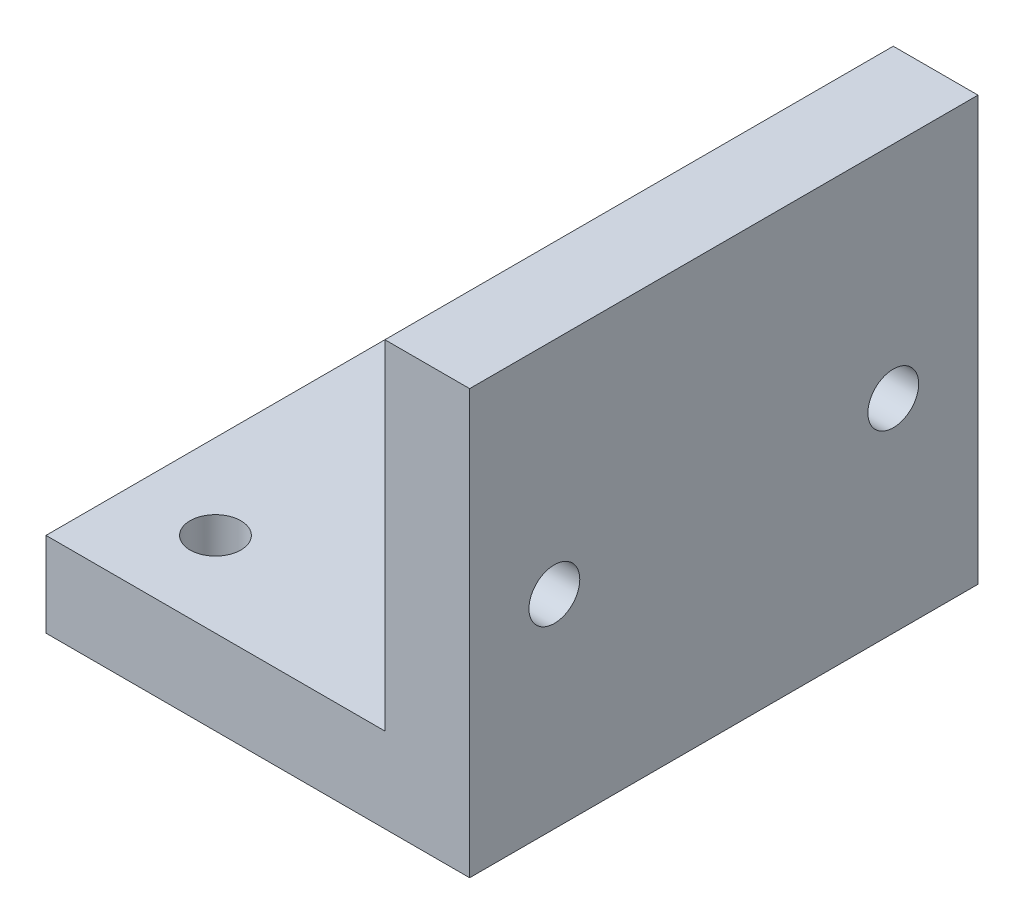
ISO-10303-21;
HEADER;
FILE_DESCRIPTION(('STEP AP214'),'2;1');
FILE_NAME('part.step','',(''),(''),'','','');
FILE_SCHEMA(('AUTOMOTIVE_DESIGN { 1 0 10303 214 1 1 1 1 }'));
ENDSEC;
DATA;
#1=APPLICATION_CONTEXT('core data for automotive mechanical design processes');
#2=APPLICATION_PROTOCOL_DEFINITION('international standard','automotive_design',2000,#1);
#3=PRODUCT_CONTEXT('',#1,'mechanical');
#4=PRODUCT('Part','Part','',(#3));
#5=PRODUCT_RELATED_PRODUCT_CATEGORY('part','',(#4));
#6=PRODUCT_DEFINITION_FORMATION('','',#4);
#7=PRODUCT_DEFINITION_CONTEXT('part definition',#1,'design');
#8=PRODUCT_DEFINITION('design','',#6,#7);
#9=PRODUCT_DEFINITION_SHAPE('','',#8);
#10=(LENGTH_UNIT() NAMED_UNIT(*) SI_UNIT(.MILLI.,.METRE.));
#11=(NAMED_UNIT(*) PLANE_ANGLE_UNIT() SI_UNIT($,.RADIAN.));
#12=(NAMED_UNIT(*) SI_UNIT($,.STERADIAN.) SOLID_ANGLE_UNIT());
#13=UNCERTAINTY_MEASURE_WITH_UNIT(LENGTH_MEASURE(1.E-05),#10,'distance_accuracy_value','');
#14=(GEOMETRIC_REPRESENTATION_CONTEXT(3) GLOBAL_UNCERTAINTY_ASSIGNED_CONTEXT((#13)) GLOBAL_UNIT_ASSIGNED_CONTEXT((#10,
#11,#12)) REPRESENTATION_CONTEXT('',''));
#15=CARTESIAN_POINT('',(0.,0.,0.));
#16=DIRECTION('',(0.,0.,1.));
#17=DIRECTION('',(1.,0.,0.));
#18=AXIS2_PLACEMENT_3D('',#15,#16,#17);
#19=CARTESIAN_POINT('',(0.,-5.,30.));
#20=DIRECTION('',(1.,0.,0.));
#21=DIRECTION('',(0.,0.,-1.));
#22=AXIS2_PLACEMENT_3D('',#19,#20,#21);
#23=PLANE('',#22);
#24=DIRECTION('',(0.,-1.,0.));
#25=VECTOR('',#24,1.);
#26=CARTESIAN_POINT('',(0.,-5.,0.));
#27=LINE('',#26,#25);
#28=CARTESIAN_POINT('',(0.,0.,0.));
#29=VERTEX_POINT('',#28);
#30=CARTESIAN_POINT('',(0.,-5.,0.));
#31=VERTEX_POINT('',#30);
#32=EDGE_CURVE('E130',#29,#31,#27,.T.);
#33=ORIENTED_EDGE('',*,*,#32,.T.);
#34=DIRECTION('',(0.,0.,-1.));
#35=VECTOR('',#34,1.);
#36=CARTESIAN_POINT('',(0.,-5.,30.));
#37=LINE('',#36,#35);
#38=CARTESIAN_POINT('',(0.,-5.,30.));
#39=VERTEX_POINT('',#38);
#40=EDGE_CURVE('E11',#39,#31,#37,.T.);
#41=ORIENTED_EDGE('',*,*,#40,.F.);
#42=DIRECTION('',(0.,-1.,0.));
#43=VECTOR('',#42,1.);
#44=CARTESIAN_POINT('',(0.,-5.,30.));
#45=LINE('',#44,#43);
#46=CARTESIAN_POINT('',(0.,0.,30.));
#47=VERTEX_POINT('',#46);
#48=EDGE_CURVE('E147',#47,#39,#45,.T.);
#49=ORIENTED_EDGE('',*,*,#48,.F.);
#50=DIRECTION('',(0.,0.,-1.));
#51=VECTOR('',#50,1.);
#52=CARTESIAN_POINT('',(0.,0.,30.));
#53=LINE('',#52,#51);
#54=EDGE_CURVE('E126',#47,#29,#53,.T.);
#55=ORIENTED_EDGE('',*,*,#54,.T.);
#56=EDGE_LOOP('',(#33,#41,#49,#55));
#57=FACE_BOUND('',#56,.T.);
#58=ADVANCED_FACE('F39',(#57),#23,.F.);
#59=CARTESIAN_POINT('',(25.,-5.,30.));
#60=DIRECTION('',(0.,1.,0.));
#61=DIRECTION('',(-1.,0.,0.));
#62=AXIS2_PLACEMENT_3D('',#59,#60,#61);
#63=PLANE('',#62);
#64=CARTESIAN_POINT('',(5.,-5.,5.));
#65=DIRECTION('',(0.,-1.,0.));
#66=DIRECTION('',(1.,0.,0.));
#67=AXIS2_PLACEMENT_3D('',#64,#65,#66);
#68=CIRCLE('',#67,1.5);
#69=CARTESIAN_POINT('',(6.5,-5.,5.));
#70=VERTEX_POINT('',#69);
#71=EDGE_CURVE('E167',#70,#70,#68,.T.);
#72=ORIENTED_EDGE('',*,*,#71,.F.);
#73=EDGE_LOOP('',(#72));
#74=FACE_BOUND('',#73,.T.);
#75=CARTESIAN_POINT('',(5.,-5.,25.));
#76=DIRECTION('',(0.,-1.,0.));
#77=DIRECTION('',(-1.,0.,0.));
#78=AXIS2_PLACEMENT_3D('',#75,#76,#77);
#79=CIRCLE('',#78,1.5);
#80=CARTESIAN_POINT('',(3.5,-5.,25.));
#81=VERTEX_POINT('',#80);
#82=EDGE_CURVE('E175',#81,#81,#79,.T.);
#83=ORIENTED_EDGE('',*,*,#82,.F.);
#84=EDGE_LOOP('',(#83));
#85=FACE_BOUND('',#84,.T.);
#86=DIRECTION('',(1.,0.,0.));
#87=VECTOR('',#86,1.);
#88=CARTESIAN_POINT('',(25.,-5.,0.));
#89=LINE('',#88,#87);
#90=CARTESIAN_POINT('',(25.,-5.,0.));
#91=VERTEX_POINT('',#90);
#92=EDGE_CURVE('E134',#31,#91,#89,.T.);
#93=ORIENTED_EDGE('',*,*,#92,.T.);
#94=DIRECTION('',(0.,0.,-1.));
#95=VECTOR('',#94,1.);
#96=CARTESIAN_POINT('',(25.,-5.,30.));
#97=LINE('',#96,#95);
#98=CARTESIAN_POINT('',(25.,-5.,30.));
#99=VERTEX_POINT('',#98);
#100=EDGE_CURVE('E49',#99,#91,#97,.T.);
#101=ORIENTED_EDGE('',*,*,#100,.F.);
#102=DIRECTION('',(1.,0.,0.));
#103=VECTOR('',#102,1.);
#104=CARTESIAN_POINT('',(25.,-5.,30.));
#105=LINE('',#104,#103);
#106=EDGE_CURVE('E95',#39,#99,#105,.T.);
#107=ORIENTED_EDGE('',*,*,#106,.F.);
#108=ORIENTED_EDGE('',*,*,#40,.T.);
#109=EDGE_LOOP('',(#93,#101,#107,#108));
#110=FACE_BOUND('',#109,.T.);
#111=ADVANCED_FACE('F195',(#74,#85,#110),#63,.F.);
#112=CARTESIAN_POINT('',(25.,20.,30.));
#113=DIRECTION('',(-1.,0.,0.));
#114=DIRECTION('',(0.,0.,1.));
#115=AXIS2_PLACEMENT_3D('',#112,#113,#114);
#116=PLANE('',#115);
#117=CARTESIAN_POINT('',(25.,7.,25.));
#118=DIRECTION('',(1.,0.,0.));
#119=DIRECTION('',(0.,0.,-1.));
#120=AXIS2_PLACEMENT_3D('',#117,#118,#119);
#121=CIRCLE('',#120,1.5);
#122=CARTESIAN_POINT('',(25.,7.,23.5));
#123=VERTEX_POINT('',#122);
#124=EDGE_CURVE('E161',#123,#123,#121,.T.);
#125=ORIENTED_EDGE('',*,*,#124,.F.);
#126=EDGE_LOOP('',(#125));
#127=FACE_BOUND('',#126,.T.);
#128=CARTESIAN_POINT('',(25.,7.,4.99999999999999));
#129=DIRECTION('',(1.,0.,0.));
#130=DIRECTION('',(0.,0.,1.));
#131=AXIS2_PLACEMENT_3D('',#128,#129,#130);
#132=CIRCLE('',#131,1.5);
#133=CARTESIAN_POINT('',(25.,7.,6.49999999999999));
#134=VERTEX_POINT('',#133);
#135=EDGE_CURVE('E173',#134,#134,#132,.T.);
#136=ORIENTED_EDGE('',*,*,#135,.F.);
#137=EDGE_LOOP('',(#136));
#138=FACE_BOUND('',#137,.T.);
#139=DIRECTION('',(0.,1.,0.));
#140=VECTOR('',#139,1.);
#141=CARTESIAN_POINT('',(25.,20.,0.));
#142=LINE('',#141,#140);
#143=CARTESIAN_POINT('',(25.,20.,0.));
#144=VERTEX_POINT('',#143);
#145=EDGE_CURVE('E138',#91,#144,#142,.T.);
#146=ORIENTED_EDGE('',*,*,#145,.T.);
#147=DIRECTION('',(0.,0.,-1.));
#148=VECTOR('',#147,1.);
#149=CARTESIAN_POINT('',(25.,20.,30.));
#150=LINE('',#149,#148);
#151=CARTESIAN_POINT('',(25.,20.,30.));
#152=VERTEX_POINT('',#151);
#153=EDGE_CURVE('E119',#152,#144,#150,.T.);
#154=ORIENTED_EDGE('',*,*,#153,.F.);
#155=DIRECTION('',(0.,1.,0.));
#156=VECTOR('',#155,1.);
#157=CARTESIAN_POINT('',(25.,20.,30.));
#158=LINE('',#157,#156);
#159=EDGE_CURVE('E108',#99,#152,#158,.T.);
#160=ORIENTED_EDGE('',*,*,#159,.F.);
#161=ORIENTED_EDGE('',*,*,#100,.T.);
#162=EDGE_LOOP('',(#146,#154,#160,#161));
#163=FACE_BOUND('',#162,.T.);
#164=ADVANCED_FACE('F198',(#127,#138,#163),#116,.F.);
#165=CARTESIAN_POINT('',(20.,20.,30.));
#166=DIRECTION('',(0.,-1.,0.));
#167=DIRECTION('',(0.,0.,-1.));
#168=AXIS2_PLACEMENT_3D('',#165,#166,#167);
#169=PLANE('',#168);
#170=DIRECTION('',(-1.,0.,0.));
#171=VECTOR('',#170,1.);
#172=CARTESIAN_POINT('',(20.,20.,0.));
#173=LINE('',#172,#171);
#174=CARTESIAN_POINT('',(20.,20.,0.));
#175=VERTEX_POINT('',#174);
#176=EDGE_CURVE('E117',#144,#175,#173,.T.);
#177=ORIENTED_EDGE('',*,*,#176,.T.);
#178=DIRECTION('',(0.,0.,-1.));
#179=VECTOR('',#178,1.);
#180=CARTESIAN_POINT('',(20.,20.,30.));
#181=LINE('',#180,#179);
#182=CARTESIAN_POINT('',(20.,20.,30.));
#183=VERTEX_POINT('',#182);
#184=EDGE_CURVE('E114',#183,#175,#181,.T.);
#185=ORIENTED_EDGE('',*,*,#184,.F.);
#186=DIRECTION('',(-1.,0.,0.));
#187=VECTOR('',#186,1.);
#188=CARTESIAN_POINT('',(20.,20.,30.));
#189=LINE('',#188,#187);
#190=EDGE_CURVE('E102',#152,#183,#189,.T.);
#191=ORIENTED_EDGE('',*,*,#190,.F.);
#192=ORIENTED_EDGE('',*,*,#153,.T.);
#193=EDGE_LOOP('',(#177,#185,#191,#192));
#194=FACE_BOUND('',#193,.T.);
#195=ADVANCED_FACE('F115',(#194),#169,.F.);
#196=CARTESIAN_POINT('',(20.,0.,30.));
#197=DIRECTION('',(1.,0.,0.));
#198=DIRECTION('',(0.,1.,0.));
#199=AXIS2_PLACEMENT_3D('',#196,#197,#198);
#200=PLANE('',#199);
#201=CARTESIAN_POINT('',(20.,7.,25.));
#202=DIRECTION('',(1.,0.,0.));
#203=DIRECTION('',(0.,1.,0.));
#204=AXIS2_PLACEMENT_3D('',#201,#202,#203);
#205=CIRCLE('',#204,1.5);
#206=CARTESIAN_POINT('',(20.,8.5,25.));
#207=VERTEX_POINT('',#206);
#208=EDGE_CURVE('E135',#207,#207,#205,.T.);
#209=ORIENTED_EDGE('',*,*,#208,.T.);
#210=EDGE_LOOP('',(#209));
#211=FACE_BOUND('',#210,.T.);
#212=CARTESIAN_POINT('',(20.,7.,4.99999999999999));
#213=DIRECTION('',(1.,0.,0.));
#214=DIRECTION('',(0.,1.,0.));
#215=AXIS2_PLACEMENT_3D('',#212,#213,#214);
#216=CIRCLE('',#215,1.5);
#217=CARTESIAN_POINT('',(20.,8.5,4.99999999999999));
#218=VERTEX_POINT('',#217);
#219=EDGE_CURVE('E157',#218,#218,#216,.T.);
#220=ORIENTED_EDGE('',*,*,#219,.T.);
#221=EDGE_LOOP('',(#220));
#222=FACE_BOUND('',#221,.T.);
#223=DIRECTION('',(0.,-1.,0.));
#224=VECTOR('',#223,1.);
#225=CARTESIAN_POINT('',(20.,0.,0.));
#226=LINE('',#225,#224);
#227=CARTESIAN_POINT('',(20.,0.,0.));
#228=VERTEX_POINT('',#227);
#229=EDGE_CURVE('E81',#175,#228,#226,.T.);
#230=ORIENTED_EDGE('',*,*,#229,.T.);
#231=DIRECTION('',(0.,0.,-1.));
#232=VECTOR('',#231,1.);
#233=CARTESIAN_POINT('',(20.,0.,30.));
#234=LINE('',#233,#232);
#235=CARTESIAN_POINT('',(20.,0.,30.));
#236=VERTEX_POINT('',#235);
#237=EDGE_CURVE('E120',#236,#228,#234,.T.);
#238=ORIENTED_EDGE('',*,*,#237,.F.);
#239=DIRECTION('',(0.,-1.,0.));
#240=VECTOR('',#239,1.);
#241=CARTESIAN_POINT('',(20.,0.,30.));
#242=LINE('',#241,#240);
#243=EDGE_CURVE('E106',#183,#236,#242,.T.);
#244=ORIENTED_EDGE('',*,*,#243,.F.);
#245=ORIENTED_EDGE('',*,*,#184,.T.);
#246=EDGE_LOOP('',(#230,#238,#244,#245));
#247=FACE_BOUND('',#246,.T.);
#248=ADVANCED_FACE('F122',(#211,#222,#247),#200,.F.);
#249=CARTESIAN_POINT('',(0.,0.,30.));
#250=DIRECTION('',(0.,-1.,0.));
#251=DIRECTION('',(0.,0.,-1.));
#252=AXIS2_PLACEMENT_3D('',#249,#250,#251);
#253=PLANE('',#252);
#254=CARTESIAN_POINT('',(5.,0.,5.));
#255=DIRECTION('',(0.,-1.,0.));
#256=DIRECTION('',(0.,0.,-1.));
#257=AXIS2_PLACEMENT_3D('',#254,#255,#256);
#258=CIRCLE('',#257,1.5);
#259=CARTESIAN_POINT('',(5.,0.,3.5));
#260=VERTEX_POINT('',#259);
#261=EDGE_CURVE('E42',#260,#260,#258,.T.);
#262=ORIENTED_EDGE('',*,*,#261,.T.);
#263=EDGE_LOOP('',(#262));
#264=FACE_BOUND('',#263,.T.);
#265=CARTESIAN_POINT('',(5.,0.,25.));
#266=DIRECTION('',(0.,-1.,0.));
#267=DIRECTION('',(0.,0.,-1.));
#268=AXIS2_PLACEMENT_3D('',#265,#266,#267);
#269=CIRCLE('',#268,1.5);
#270=CARTESIAN_POINT('',(5.,0.,23.5));
#271=VERTEX_POINT('',#270);
#272=EDGE_CURVE('E164',#271,#271,#269,.T.);
#273=ORIENTED_EDGE('',*,*,#272,.T.);
#274=EDGE_LOOP('',(#273));
#275=FACE_BOUND('',#274,.T.);
#276=DIRECTION('',(-1.,0.,0.));
#277=VECTOR('',#276,1.);
#278=CARTESIAN_POINT('',(0.,0.,0.));
#279=LINE('',#278,#277);
#280=EDGE_CURVE('E87',#228,#29,#279,.T.);
#281=ORIENTED_EDGE('',*,*,#280,.T.);
#282=ORIENTED_EDGE('',*,*,#54,.F.);
#283=DIRECTION('',(-1.,0.,0.));
#284=VECTOR('',#283,1.);
#285=CARTESIAN_POINT('',(0.,0.,30.));
#286=LINE('',#285,#284);
#287=EDGE_CURVE('E58',#236,#47,#286,.T.);
#288=ORIENTED_EDGE('',*,*,#287,.F.);
#289=ORIENTED_EDGE('',*,*,#237,.T.);
#290=EDGE_LOOP('',(#281,#282,#288,#289));
#291=FACE_BOUND('',#290,.T.);
#292=ADVANCED_FACE('F203',(#264,#275,#291),#253,.F.);
#293=CARTESIAN_POINT('',(0.,0.,30.));
#294=DIRECTION('',(0.,0.,-1.));
#295=DIRECTION('',(-1.,0.,0.));
#296=AXIS2_PLACEMENT_3D('',#293,#294,#295);
#297=PLANE('',#296);
#298=ORIENTED_EDGE('',*,*,#48,.T.);
#299=ORIENTED_EDGE('',*,*,#106,.T.);
#300=ORIENTED_EDGE('',*,*,#159,.T.);
#301=ORIENTED_EDGE('',*,*,#190,.T.);
#302=ORIENTED_EDGE('',*,*,#243,.T.);
#303=ORIENTED_EDGE('',*,*,#287,.T.);
#304=EDGE_LOOP('',(#298,#299,#300,#301,#302,#303));
#305=FACE_BOUND('',#304,.T.);
#306=ADVANCED_FACE('F104',(#305),#297,.F.);
#307=CARTESIAN_POINT('',(0.,0.,0.));
#308=DIRECTION('',(0.,0.,-1.));
#309=DIRECTION('',(-1.,0.,0.));
#310=AXIS2_PLACEMENT_3D('',#307,#308,#309);
#311=PLANE('',#310);
#312=ORIENTED_EDGE('',*,*,#32,.F.);
#313=ORIENTED_EDGE('',*,*,#280,.F.);
#314=ORIENTED_EDGE('',*,*,#229,.F.);
#315=ORIENTED_EDGE('',*,*,#176,.F.);
#316=ORIENTED_EDGE('',*,*,#145,.F.);
#317=ORIENTED_EDGE('',*,*,#92,.F.);
#318=EDGE_LOOP('',(#312,#313,#314,#315,#316,#317));
#319=FACE_BOUND('',#318,.T.);
#320=ADVANCED_FACE('F201',(#319),#311,.T.);
#321=CARTESIAN_POINT('',(-5.,7.,4.99999999999999));
#322=DIRECTION('',(1.,0.,0.));
#323=DIRECTION('',(0.,0.,-1.));
#324=AXIS2_PLACEMENT_3D('',#321,#322,#323);
#325=CYLINDRICAL_SURFACE('',#324,1.5);
#326=ORIENTED_EDGE('',*,*,#135,.T.);
#327=EDGE_LOOP('',(#326));
#328=FACE_BOUND('',#327,.T.);
#329=ORIENTED_EDGE('',*,*,#219,.F.);
#330=EDGE_LOOP('',(#329));
#331=FACE_BOUND('',#330,.T.);
#332=ADVANCED_FACE('F246',(#328,#331),#325,.F.);
#333=CARTESIAN_POINT('',(-5.,7.,25.));
#334=DIRECTION('',(1.,0.,0.));
#335=DIRECTION('',(0.,0.,-1.));
#336=AXIS2_PLACEMENT_3D('',#333,#334,#335);
#337=CYLINDRICAL_SURFACE('',#336,1.5);
#338=ORIENTED_EDGE('',*,*,#124,.T.);
#339=EDGE_LOOP('',(#338));
#340=FACE_BOUND('',#339,.T.);
#341=ORIENTED_EDGE('',*,*,#208,.F.);
#342=EDGE_LOOP('',(#341));
#343=FACE_BOUND('',#342,.T.);
#344=ADVANCED_FACE('F251',(#340,#343),#337,.F.);
#345=CARTESIAN_POINT('',(5.,25.,25.));
#346=DIRECTION('',(0.,-1.,0.));
#347=DIRECTION('',(1.,0.,0.));
#348=AXIS2_PLACEMENT_3D('',#345,#346,#347);
#349=CYLINDRICAL_SURFACE('',#348,1.5);
#350=ORIENTED_EDGE('',*,*,#82,.T.);
#351=EDGE_LOOP('',(#350));
#352=FACE_BOUND('',#351,.T.);
#353=ORIENTED_EDGE('',*,*,#272,.F.);
#354=EDGE_LOOP('',(#353));
#355=FACE_BOUND('',#354,.T.);
#356=ADVANCED_FACE('F262',(#352,#355),#349,.F.);
#357=CARTESIAN_POINT('',(5.,25.,5.));
#358=DIRECTION('',(0.,-1.,0.));
#359=DIRECTION('',(1.,0.,0.));
#360=AXIS2_PLACEMENT_3D('',#357,#358,#359);
#361=CYLINDRICAL_SURFACE('',#360,1.5);
#362=ORIENTED_EDGE('',*,*,#71,.T.);
#363=EDGE_LOOP('',(#362));
#364=FACE_BOUND('',#363,.T.);
#365=ORIENTED_EDGE('',*,*,#261,.F.);
#366=EDGE_LOOP('',(#365));
#367=FACE_BOUND('',#366,.T.);
#368=ADVANCED_FACE('F282',(#364,#367),#361,.F.);
#369=CLOSED_SHELL('',(#58,#111,#164,#195,#248,#292,#306,#320,#332,#344,#356,#368));
#370=MANIFOLD_SOLID_BREP('B2',#369);
#371=ADVANCED_BREP_SHAPE_REPRESENTATION('',(#18,#370),#14);
#372=SHAPE_DEFINITION_REPRESENTATION(#9,#371);
ENDSEC;
END-ISO-10303-21;
